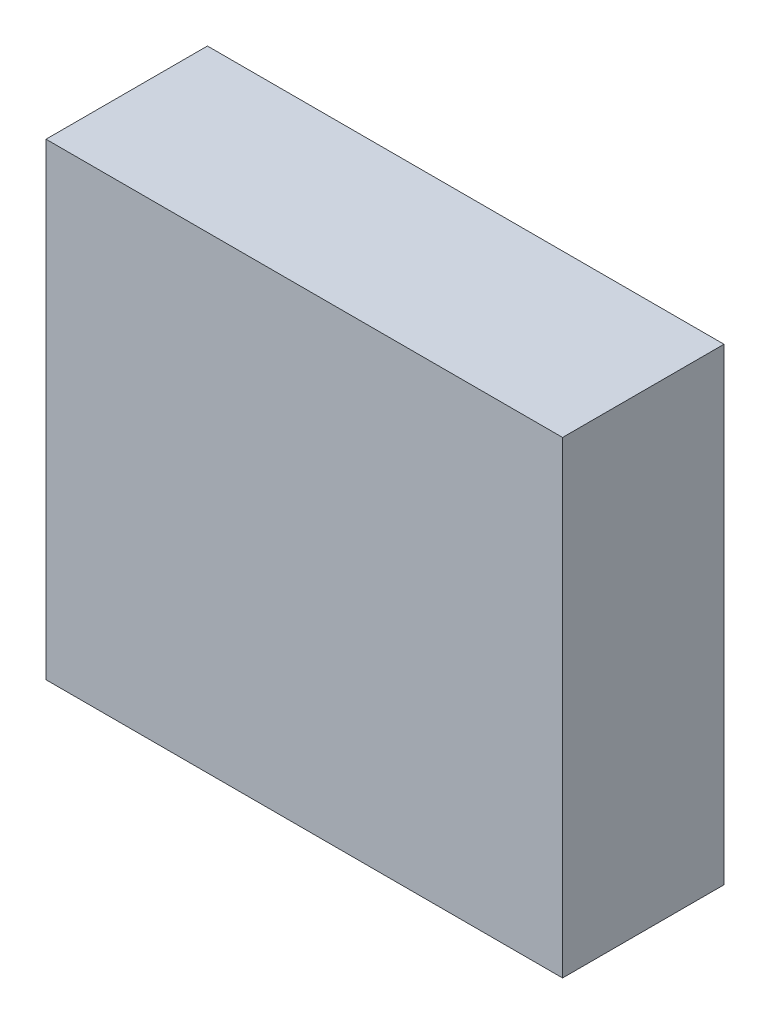
ISO-10303-21;
HEADER;
FILE_DESCRIPTION(('STEP AP214'),'2;1');
FILE_NAME('part.step','',(''),(''),'','','');
FILE_SCHEMA(('AUTOMOTIVE_DESIGN { 1 0 10303 214 1 1 1 1 }'));
ENDSEC;
DATA;
#1=APPLICATION_CONTEXT('core data for automotive mechanical design processes');
#2=APPLICATION_PROTOCOL_DEFINITION('international standard','automotive_design',2000,#1);
#3=PRODUCT_CONTEXT('',#1,'mechanical');
#4=PRODUCT('Part','Part','',(#3));
#5=PRODUCT_RELATED_PRODUCT_CATEGORY('part','',(#4));
#6=PRODUCT_DEFINITION_FORMATION('','',#4);
#7=PRODUCT_DEFINITION_CONTEXT('part definition',#1,'design');
#8=PRODUCT_DEFINITION('design','',#6,#7);
#9=PRODUCT_DEFINITION_SHAPE('','',#8);
#10=(LENGTH_UNIT() NAMED_UNIT(*) SI_UNIT(.MILLI.,.METRE.));
#11=(NAMED_UNIT(*) PLANE_ANGLE_UNIT() SI_UNIT($,.RADIAN.));
#12=(NAMED_UNIT(*) SI_UNIT($,.STERADIAN.) SOLID_ANGLE_UNIT());
#13=UNCERTAINTY_MEASURE_WITH_UNIT(LENGTH_MEASURE(1.E-05),#10,'distance_accuracy_value','');
#14=(GEOMETRIC_REPRESENTATION_CONTEXT(3) GLOBAL_UNCERTAINTY_ASSIGNED_CONTEXT((#13)) GLOBAL_UNIT_ASSIGNED_CONTEXT((#10,
#11,#12)) REPRESENTATION_CONTEXT('',''));
#15=CARTESIAN_POINT('',(0.,0.,0.));
#16=DIRECTION('',(0.,0.,1.));
#17=DIRECTION('',(1.,0.,0.));
#18=AXIS2_PLACEMENT_3D('',#15,#16,#17);
#19=CARTESIAN_POINT('',(-0.799998198464863,-0.724997061386929,-2.64111989736557));
#20=DIRECTION('',(-8.74227765734759E-08,-1.,0.));
#21=DIRECTION('',(1.,-8.74227765734759E-08,0.));
#22=AXIS2_PLACEMENT_3D('',#19,#20,#21);
#23=PLANE('',#22);
#24=DIRECTION('',(0.999999999999996,-8.74227765791676E-08,0.));
#25=VECTOR('',#24,1.);
#26=CARTESIAN_POINT('',(-0.799998198464863,-0.724997061386929,-2.64111989736557));
#27=LINE('',#26,#25);
#28=CARTESIAN_POINT('',(-0.799998198464863,-0.724997061386929,-2.64111989736557));
#29=VERTEX_POINT('',#28);
#30=CARTESIAN_POINT('',(0.800007905050762,-0.724997201263903,-2.64111989736557));
#31=VERTEX_POINT('',#30);
#32=EDGE_CURVE('E11',#29,#31,#27,.T.);
#33=ORIENTED_EDGE('',*,*,#32,.T.);
#34=DIRECTION('',(0.,0.,1.));
#35=VECTOR('',#34,1.);
#36=CARTESIAN_POINT('',(0.800007905050762,-0.724997201263906,-2.64111989736557));
#37=LINE('',#36,#35);
#38=CARTESIAN_POINT('',(0.800007905050762,-0.724997201263903,-2.14112091064453));
#39=VERTEX_POINT('',#38);
#40=EDGE_CURVE('E88',#31,#39,#37,.T.);
#41=ORIENTED_EDGE('',*,*,#40,.T.);
#42=DIRECTION('',(0.999999999999996,-8.74227765791676E-08,0.));
#43=VECTOR('',#42,1.);
#44=CARTESIAN_POINT('',(-0.799998198464863,-0.724997061386929,-2.14112091064453));
#45=LINE('',#44,#43);
#46=CARTESIAN_POINT('',(-0.799998198464863,-0.724997061386929,-2.14112091064453));
#47=VERTEX_POINT('',#46);
#48=EDGE_CURVE('E83',#47,#39,#45,.T.);
#49=ORIENTED_EDGE('',*,*,#48,.F.);
#50=DIRECTION('',(0.,0.,1.));
#51=VECTOR('',#50,1.);
#52=CARTESIAN_POINT('',(-0.799998198464879,-0.724997061386929,-2.64111989736557));
#53=LINE('',#52,#51);
#54=EDGE_CURVE('E72',#29,#47,#53,.T.);
#55=ORIENTED_EDGE('',*,*,#54,.F.);
#56=EDGE_LOOP('',(#33,#41,#49,#55));
#57=FACE_BOUND('',#56,.T.);
#58=ADVANCED_FACE('F17',(#57),#23,.T.);
#59=CARTESIAN_POINT('',(0.800007905050762,-0.724997201263903,-2.64111989736557));
#60=DIRECTION('',(1.,-8.74227765734759E-08,0.));
#61=DIRECTION('',(8.74227765734759E-08,1.,0.));
#62=AXIS2_PLACEMENT_3D('',#59,#60,#61);
#63=PLANE('',#62);
#64=DIRECTION('',(8.74227765590445E-08,0.999999999999996,0.));
#65=VECTOR('',#64,1.);
#66=CARTESIAN_POINT('',(0.800007905050762,-0.724997201263903,-2.64111989736557));
#67=LINE('',#66,#65);
#68=CARTESIAN_POINT('',(0.800008031814173,0.725007376372815,-2.64111989736557));
#69=VERTEX_POINT('',#68);
#70=EDGE_CURVE('E24',#31,#69,#67,.T.);
#71=ORIENTED_EDGE('',*,*,#70,.T.);
#72=DIRECTION('',(0.,0.,1.));
#73=VECTOR('',#72,1.);
#74=CARTESIAN_POINT('',(0.800008031814188,0.725007376372815,-2.64111989736557));
#75=LINE('',#74,#73);
#76=CARTESIAN_POINT('',(0.800008031814173,0.725007376372815,-2.14112091064453));
#77=VERTEX_POINT('',#76);
#78=EDGE_CURVE('E85',#69,#77,#75,.T.);
#79=ORIENTED_EDGE('',*,*,#78,.T.);
#80=DIRECTION('',(8.74227765590445E-08,0.999999999999996,0.));
#81=VECTOR('',#80,1.);
#82=CARTESIAN_POINT('',(0.800007905050762,-0.724997201263903,-2.14112091064453));
#83=LINE('',#82,#81);
#84=EDGE_CURVE('E66',#39,#77,#83,.T.);
#85=ORIENTED_EDGE('',*,*,#84,.F.);
#86=ORIENTED_EDGE('',*,*,#40,.F.);
#87=EDGE_LOOP('',(#71,#79,#85,#86));
#88=FACE_BOUND('',#87,.T.);
#89=ADVANCED_FACE('F89',(#88),#63,.T.);
#90=CARTESIAN_POINT('',(0.800008031814173,0.725007376372815,-2.64111989736557));
#91=DIRECTION('',(8.74227765734759E-08,1.,0.));
#92=DIRECTION('',(-1.,8.74227765734759E-08,0.));
#93=AXIS2_PLACEMENT_3D('',#90,#91,#92);
#94=PLANE('',#93);
#95=DIRECTION('',(-0.999999999999996,8.74227765791676E-08,0.));
#96=VECTOR('',#95,1.);
#97=CARTESIAN_POINT('',(0.800008031814173,0.725007376372815,-2.64111989736557));
#98=LINE('',#97,#96);
#99=CARTESIAN_POINT('',(-0.799998071701452,0.725007516249789,-2.64111989736557));
#100=VERTEX_POINT('',#99);
#101=EDGE_CURVE('E62',#69,#100,#98,.T.);
#102=ORIENTED_EDGE('',*,*,#101,.T.);
#103=DIRECTION('',(0.,0.,1.));
#104=VECTOR('',#103,1.);
#105=CARTESIAN_POINT('',(-0.799998071701452,0.725007516249791,-2.64111989736557));
#106=LINE('',#105,#104);
#107=CARTESIAN_POINT('',(-0.799998071701452,0.725007516249789,-2.14112091064453));
#108=VERTEX_POINT('',#107);
#109=EDGE_CURVE('E55',#100,#108,#106,.T.);
#110=ORIENTED_EDGE('',*,*,#109,.T.);
#111=DIRECTION('',(-0.999999999999996,8.74227765791676E-08,0.));
#112=VECTOR('',#111,1.);
#113=CARTESIAN_POINT('',(0.800008031814173,0.725007376372815,-2.14112091064453));
#114=LINE('',#113,#112);
#115=EDGE_CURVE('E59',#77,#108,#114,.T.);
#116=ORIENTED_EDGE('',*,*,#115,.F.);
#117=ORIENTED_EDGE('',*,*,#78,.F.);
#118=EDGE_LOOP('',(#102,#110,#116,#117));
#119=FACE_BOUND('',#118,.T.);
#120=ADVANCED_FACE('F57',(#119),#94,.T.);
#121=CARTESIAN_POINT('',(-0.799998071701452,0.725007516249789,-2.64111989736557));
#122=DIRECTION('',(-1.,8.74227765734759E-08,0.));
#123=DIRECTION('',(-8.74227765734759E-08,-1.,0.));
#124=AXIS2_PLACEMENT_3D('',#121,#122,#123);
#125=PLANE('',#124);
#126=DIRECTION('',(-8.74227765590445E-08,-0.999999999999996,0.));
#127=VECTOR('',#126,1.);
#128=CARTESIAN_POINT('',(-0.799998071701452,0.725007516249789,-2.64111989736557));
#129=LINE('',#128,#127);
#130=EDGE_CURVE('E65',#100,#29,#129,.T.);
#131=ORIENTED_EDGE('',*,*,#130,.T.);
#132=ORIENTED_EDGE('',*,*,#54,.T.);
#133=DIRECTION('',(-8.74227765590445E-08,-0.999999999999996,0.));
#134=VECTOR('',#133,1.);
#135=CARTESIAN_POINT('',(-0.799998071701452,0.725007516249789,-2.14112091064453));
#136=LINE('',#135,#134);
#137=EDGE_CURVE('E70',#108,#47,#136,.T.);
#138=ORIENTED_EDGE('',*,*,#137,.F.);
#139=ORIENTED_EDGE('',*,*,#109,.F.);
#140=EDGE_LOOP('',(#131,#132,#138,#139));
#141=FACE_BOUND('',#140,.T.);
#142=ADVANCED_FACE('F71',(#141),#125,.T.);
#143=CARTESIAN_POINT('',(189.900009155273,118.299987792969,-2.14112091064453));
#144=DIRECTION('',(0.,0.,1.));
#145=DIRECTION('',(-1.,8.74227765734759E-08,0.));
#146=AXIS2_PLACEMENT_3D('',#143,#144,#145);
#147=PLANE('',#146);
#148=ORIENTED_EDGE('',*,*,#48,.T.);
#149=ORIENTED_EDGE('',*,*,#84,.T.);
#150=ORIENTED_EDGE('',*,*,#115,.T.);
#151=ORIENTED_EDGE('',*,*,#137,.T.);
#152=EDGE_LOOP('',(#148,#149,#150,#151));
#153=FACE_BOUND('',#152,.T.);
#154=ADVANCED_FACE('F76',(#153),#147,.T.);
#155=CARTESIAN_POINT('',(189.900009155273,118.299987792969,-2.64111989736557));
#156=DIRECTION('',(0.,0.,1.));
#157=DIRECTION('',(-1.,8.74227765734759E-08,0.));
#158=AXIS2_PLACEMENT_3D('',#155,#156,#157);
#159=PLANE('',#158);
#160=ORIENTED_EDGE('',*,*,#130,.F.);
#161=ORIENTED_EDGE('',*,*,#101,.F.);
#162=ORIENTED_EDGE('',*,*,#70,.F.);
#163=ORIENTED_EDGE('',*,*,#32,.F.);
#164=EDGE_LOOP('',(#160,#161,#162,#163));
#165=FACE_BOUND('',#164,.T.);
#166=ADVANCED_FACE('F91',(#165),#159,.F.);
#167=CLOSED_SHELL('',(#58,#89,#120,#142,#154,#166));
#168=MANIFOLD_SOLID_BREP('B1',#167);
#169=ADVANCED_BREP_SHAPE_REPRESENTATION('',(#18,#168),#14);
#170=SHAPE_DEFINITION_REPRESENTATION(#9,#169);
ENDSEC;
END-ISO-10303-21;
